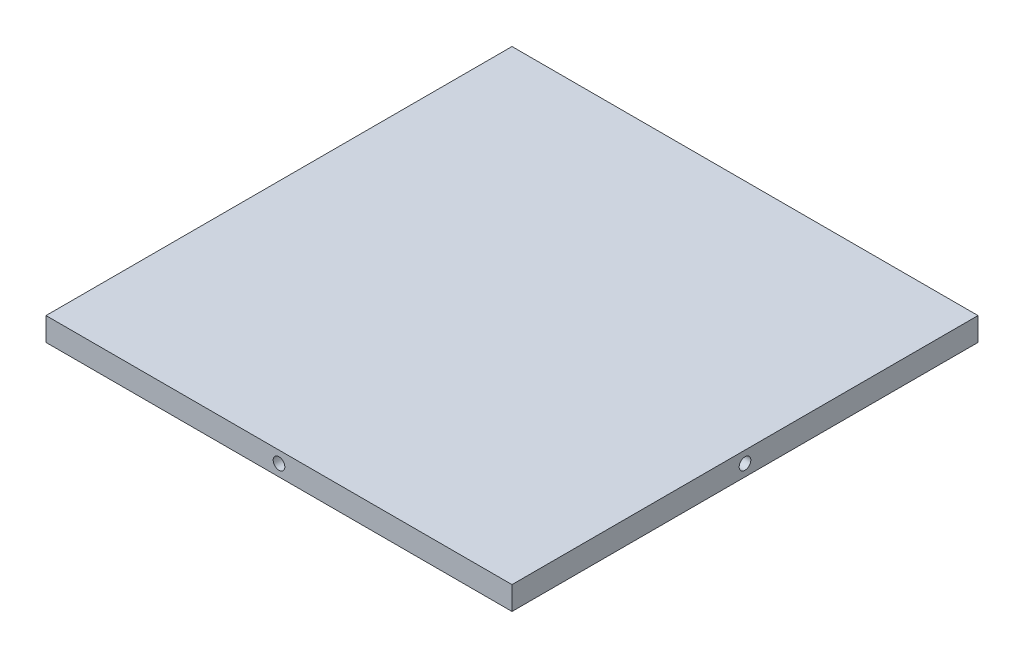
ISO-10303-21;
HEADER;
FILE_DESCRIPTION(('STEP AP214'),'2;1');
FILE_NAME('part.step','',(''),(''),'','','');
FILE_SCHEMA(('AUTOMOTIVE_DESIGN { 1 0 10303 214 1 1 1 1 }'));
ENDSEC;
DATA;
#1=APPLICATION_CONTEXT('core data for automotive mechanical design processes');
#2=APPLICATION_PROTOCOL_DEFINITION('international standard','automotive_design',2000,#1);
#3=PRODUCT_CONTEXT('',#1,'mechanical');
#4=PRODUCT('Part','Part','',(#3));
#5=PRODUCT_RELATED_PRODUCT_CATEGORY('part','',(#4));
#6=PRODUCT_DEFINITION_FORMATION('','',#4);
#7=PRODUCT_DEFINITION_CONTEXT('part definition',#1,'design');
#8=PRODUCT_DEFINITION('design','',#6,#7);
#9=PRODUCT_DEFINITION_SHAPE('','',#8);
#10=(LENGTH_UNIT() NAMED_UNIT(*) SI_UNIT(.MILLI.,.METRE.));
#11=(NAMED_UNIT(*) PLANE_ANGLE_UNIT() SI_UNIT($,.RADIAN.));
#12=(NAMED_UNIT(*) SI_UNIT($,.STERADIAN.) SOLID_ANGLE_UNIT());
#13=UNCERTAINTY_MEASURE_WITH_UNIT(LENGTH_MEASURE(1.E-05),#10,'distance_accuracy_value','');
#14=(GEOMETRIC_REPRESENTATION_CONTEXT(3) GLOBAL_UNCERTAINTY_ASSIGNED_CONTEXT((#13)) GLOBAL_UNIT_ASSIGNED_CONTEXT((#10,
#11,#12)) REPRESENTATION_CONTEXT('',''));
#15=CARTESIAN_POINT('',(0.,0.,0.));
#16=DIRECTION('',(0.,0.,1.));
#17=DIRECTION('',(1.,0.,0.));
#18=AXIS2_PLACEMENT_3D('',#15,#16,#17);
#19=CARTESIAN_POINT('',(60.,6.,60.));
#20=DIRECTION('',(-1.,0.,0.));
#21=DIRECTION('',(0.,0.,1.));
#22=AXIS2_PLACEMENT_3D('',#19,#20,#21);
#23=PLANE('',#22);
#24=CARTESIAN_POINT('',(60.,3.,0.));
#25=DIRECTION('',(1.,0.,0.));
#26=DIRECTION('',(0.,0.,-1.));
#27=AXIS2_PLACEMENT_3D('',#24,#25,#26);
#28=CIRCLE('',#27,1.5);
#29=CARTESIAN_POINT('',(60.,3.,-1.50000000000001));
#30=VERTEX_POINT('',#29);
#31=EDGE_CURVE('E127',#30,#30,#28,.T.);
#32=ORIENTED_EDGE('',*,*,#31,.F.);
#33=EDGE_LOOP('',(#32));
#34=FACE_BOUND('',#33,.T.);
#35=DIRECTION('',(0.,0.,-1.));
#36=VECTOR('',#35,1.);
#37=CARTESIAN_POINT('',(60.,0.,60.));
#38=LINE('',#37,#36);
#39=CARTESIAN_POINT('',(60.,0.,60.));
#40=VERTEX_POINT('',#39);
#41=CARTESIAN_POINT('',(60.,0.,-60.));
#42=VERTEX_POINT('',#41);
#43=EDGE_CURVE('E106',#40,#42,#38,.T.);
#44=ORIENTED_EDGE('',*,*,#43,.T.);
#45=DIRECTION('',(0.,-1.,0.));
#46=VECTOR('',#45,1.);
#47=CARTESIAN_POINT('',(60.,6.,-60.));
#48=LINE('',#47,#46);
#49=CARTESIAN_POINT('',(60.,6.,-60.));
#50=VERTEX_POINT('',#49);
#51=EDGE_CURVE('E11',#50,#42,#48,.T.);
#52=ORIENTED_EDGE('',*,*,#51,.F.);
#53=DIRECTION('',(0.,0.,-1.));
#54=VECTOR('',#53,1.);
#55=CARTESIAN_POINT('',(60.,6.,60.));
#56=LINE('',#55,#54);
#57=CARTESIAN_POINT('',(60.,6.,60.));
#58=VERTEX_POINT('',#57);
#59=EDGE_CURVE('E90',#58,#50,#56,.T.);
#60=ORIENTED_EDGE('',*,*,#59,.F.);
#61=DIRECTION('',(0.,-1.,0.));
#62=VECTOR('',#61,1.);
#63=CARTESIAN_POINT('',(60.,6.,60.));
#64=LINE('',#63,#62);
#65=EDGE_CURVE('E102',#58,#40,#64,.T.);
#66=ORIENTED_EDGE('',*,*,#65,.T.);
#67=EDGE_LOOP('',(#44,#52,#60,#66));
#68=FACE_BOUND('',#67,.T.);
#69=ADVANCED_FACE('F38',(#34,#68),#23,.F.);
#70=CARTESIAN_POINT('',(-60.,6.,-60.));
#71=DIRECTION('',(0.,0.,1.));
#72=DIRECTION('',(1.,0.,0.));
#73=AXIS2_PLACEMENT_3D('',#70,#71,#72);
#74=PLANE('',#73);
#75=CARTESIAN_POINT('',(0.,3.,-60.));
#76=DIRECTION('',(0.,0.,-1.));
#77=DIRECTION('',(-1.,0.,0.));
#78=AXIS2_PLACEMENT_3D('',#75,#76,#77);
#79=CIRCLE('',#78,1.5);
#80=CARTESIAN_POINT('',(-1.49999999999999,3.,-60.));
#81=VERTEX_POINT('',#80);
#82=EDGE_CURVE('E135',#81,#81,#79,.T.);
#83=ORIENTED_EDGE('',*,*,#82,.F.);
#84=EDGE_LOOP('',(#83));
#85=FACE_BOUND('',#84,.T.);
#86=DIRECTION('',(-1.,0.,0.));
#87=VECTOR('',#86,1.);
#88=CARTESIAN_POINT('',(-60.,0.,-60.));
#89=LINE('',#88,#87);
#90=CARTESIAN_POINT('',(-60.,0.,-60.));
#91=VERTEX_POINT('',#90);
#92=EDGE_CURVE('E95',#42,#91,#89,.T.);
#93=ORIENTED_EDGE('',*,*,#92,.T.);
#94=DIRECTION('',(0.,-1.,0.));
#95=VECTOR('',#94,1.);
#96=CARTESIAN_POINT('',(-60.,6.,-60.));
#97=LINE('',#96,#95);
#98=CARTESIAN_POINT('',(-60.,6.,-60.));
#99=VERTEX_POINT('',#98);
#100=EDGE_CURVE('E47',#99,#91,#97,.T.);
#101=ORIENTED_EDGE('',*,*,#100,.F.);
#102=DIRECTION('',(-1.,0.,0.));
#103=VECTOR('',#102,1.);
#104=CARTESIAN_POINT('',(-60.,6.,-60.));
#105=LINE('',#104,#103);
#106=EDGE_CURVE('E85',#50,#99,#105,.T.);
#107=ORIENTED_EDGE('',*,*,#106,.F.);
#108=ORIENTED_EDGE('',*,*,#51,.T.);
#109=EDGE_LOOP('',(#93,#101,#107,#108));
#110=FACE_BOUND('',#109,.T.);
#111=ADVANCED_FACE('F94',(#85,#110),#74,.F.);
#112=CARTESIAN_POINT('',(-60.,6.,60.));
#113=DIRECTION('',(1.,0.,0.));
#114=DIRECTION('',(0.,0.,-1.));
#115=AXIS2_PLACEMENT_3D('',#112,#113,#114);
#116=PLANE('',#115);
#117=CARTESIAN_POINT('',(-60.,3.,0.));
#118=DIRECTION('',(-1.,0.,0.));
#119=DIRECTION('',(0.,0.,1.));
#120=AXIS2_PLACEMENT_3D('',#117,#118,#119);
#121=CIRCLE('',#120,1.5);
#122=CARTESIAN_POINT('',(-60.,3.,1.50000000000001));
#123=VERTEX_POINT('',#122);
#124=EDGE_CURVE('E143',#123,#123,#121,.T.);
#125=ORIENTED_EDGE('',*,*,#124,.F.);
#126=EDGE_LOOP('',(#125));
#127=FACE_BOUND('',#126,.T.);
#128=DIRECTION('',(0.,0.,1.));
#129=VECTOR('',#128,1.);
#130=CARTESIAN_POINT('',(-60.,0.,60.));
#131=LINE('',#130,#129);
#132=CARTESIAN_POINT('',(-60.,0.,60.));
#133=VERTEX_POINT('',#132);
#134=EDGE_CURVE('E72',#91,#133,#131,.T.);
#135=ORIENTED_EDGE('',*,*,#134,.T.);
#136=DIRECTION('',(0.,-1.,0.));
#137=VECTOR('',#136,1.);
#138=CARTESIAN_POINT('',(-60.,6.,60.));
#139=LINE('',#138,#137);
#140=CARTESIAN_POINT('',(-60.,6.,60.));
#141=VERTEX_POINT('',#140);
#142=EDGE_CURVE('E97',#141,#133,#139,.T.);
#143=ORIENTED_EDGE('',*,*,#142,.F.);
#144=DIRECTION('',(0.,0.,1.));
#145=VECTOR('',#144,1.);
#146=CARTESIAN_POINT('',(-60.,6.,60.));
#147=LINE('',#146,#145);
#148=EDGE_CURVE('E88',#99,#141,#147,.T.);
#149=ORIENTED_EDGE('',*,*,#148,.F.);
#150=ORIENTED_EDGE('',*,*,#100,.T.);
#151=EDGE_LOOP('',(#135,#143,#149,#150));
#152=FACE_BOUND('',#151,.T.);
#153=ADVANCED_FACE('F98',(#127,#152),#116,.F.);
#154=CARTESIAN_POINT('',(-60.,6.,60.));
#155=DIRECTION('',(0.,0.,-1.));
#156=DIRECTION('',(-1.,0.,0.));
#157=AXIS2_PLACEMENT_3D('',#154,#155,#156);
#158=PLANE('',#157);
#159=CARTESIAN_POINT('',(0.,3.,60.));
#160=DIRECTION('',(0.,0.,1.));
#161=DIRECTION('',(1.,0.,0.));
#162=AXIS2_PLACEMENT_3D('',#159,#160,#161);
#163=CIRCLE('',#162,1.5);
#164=CARTESIAN_POINT('',(1.50000000000002,3.,60.));
#165=VERTEX_POINT('',#164);
#166=EDGE_CURVE('E151',#165,#165,#163,.T.);
#167=ORIENTED_EDGE('',*,*,#166,.F.);
#168=EDGE_LOOP('',(#167));
#169=FACE_BOUND('',#168,.T.);
#170=DIRECTION('',(1.,0.,0.));
#171=VECTOR('',#170,1.);
#172=CARTESIAN_POINT('',(-60.,0.,60.));
#173=LINE('',#172,#171);
#174=EDGE_CURVE('E78',#133,#40,#173,.T.);
#175=ORIENTED_EDGE('',*,*,#174,.T.);
#176=ORIENTED_EDGE('',*,*,#65,.F.);
#177=DIRECTION('',(1.,0.,0.));
#178=VECTOR('',#177,1.);
#179=CARTESIAN_POINT('',(-60.,6.,60.));
#180=LINE('',#179,#178);
#181=EDGE_CURVE('E55',#141,#58,#180,.T.);
#182=ORIENTED_EDGE('',*,*,#181,.F.);
#183=ORIENTED_EDGE('',*,*,#142,.T.);
#184=EDGE_LOOP('',(#175,#176,#182,#183));
#185=FACE_BOUND('',#184,.T.);
#186=ADVANCED_FACE('F120',(#169,#185),#158,.F.);
#187=CARTESIAN_POINT('',(0.,6.,0.));
#188=DIRECTION('',(0.,-1.,0.));
#189=DIRECTION('',(0.,0.,-1.));
#190=AXIS2_PLACEMENT_3D('',#187,#188,#189);
#191=PLANE('',#190);
#192=ORIENTED_EDGE('',*,*,#59,.T.);
#193=ORIENTED_EDGE('',*,*,#106,.T.);
#194=ORIENTED_EDGE('',*,*,#148,.T.);
#195=ORIENTED_EDGE('',*,*,#181,.T.);
#196=EDGE_LOOP('',(#192,#193,#194,#195));
#197=FACE_BOUND('',#196,.T.);
#198=ADVANCED_FACE('F86',(#197),#191,.F.);
#199=CARTESIAN_POINT('',(0.,0.,0.));
#200=DIRECTION('',(0.,-1.,0.));
#201=DIRECTION('',(0.,0.,-1.));
#202=AXIS2_PLACEMENT_3D('',#199,#200,#201);
#203=PLANE('',#202);
#204=ORIENTED_EDGE('',*,*,#43,.F.);
#205=ORIENTED_EDGE('',*,*,#174,.F.);
#206=ORIENTED_EDGE('',*,*,#134,.F.);
#207=ORIENTED_EDGE('',*,*,#92,.F.);
#208=EDGE_LOOP('',(#204,#205,#206,#207));
#209=FACE_BOUND('',#208,.T.);
#210=ADVANCED_FACE('F123',(#209),#203,.T.);
#211=CARTESIAN_POINT('',(44.,3.,0.));
#212=DIRECTION('',(1.,0.,0.));
#213=DIRECTION('',(0.,0.,-1.));
#214=AXIS2_PLACEMENT_3D('',#211,#212,#213);
#215=CYLINDRICAL_SURFACE('',#214,1.5);
#216=CARTESIAN_POINT('',(44.,3.,0.));
#217=DIRECTION('',(1.,0.,0.));
#218=DIRECTION('',(0.,0.,-1.));
#219=AXIS2_PLACEMENT_3D('',#216,#217,#218);
#220=CIRCLE('',#219,1.5);
#221=CARTESIAN_POINT('',(44.,3.,-1.50000000000001));
#222=VERTEX_POINT('',#221);
#223=EDGE_CURVE('E110',#222,#222,#220,.T.);
#224=ORIENTED_EDGE('',*,*,#223,.F.);
#225=EDGE_LOOP('',(#224));
#226=FACE_BOUND('',#225,.T.);
#227=ORIENTED_EDGE('',*,*,#31,.T.);
#228=EDGE_LOOP('',(#227));
#229=FACE_BOUND('',#228,.T.);
#230=ADVANCED_FACE('F190',(#226,#229),#215,.F.);
#231=CARTESIAN_POINT('',(44.,3.,0.));
#232=DIRECTION('',(1.,0.,0.));
#233=DIRECTION('',(0.,0.,-1.));
#234=AXIS2_PLACEMENT_3D('',#231,#232,#233);
#235=PLANE('',#234);
#236=ORIENTED_EDGE('',*,*,#223,.T.);
#237=EDGE_LOOP('',(#236));
#238=FACE_BOUND('',#237,.T.);
#239=ADVANCED_FACE('F192',(#238),#235,.T.);
#240=CARTESIAN_POINT('',(0.,3.,-44.));
#241=DIRECTION('',(0.,0.,-1.));
#242=DIRECTION('',(-1.,0.,0.));
#243=AXIS2_PLACEMENT_3D('',#240,#241,#242);
#244=CYLINDRICAL_SURFACE('',#243,1.5);
#245=CARTESIAN_POINT('',(0.,3.,-44.));
#246=DIRECTION('',(0.,0.,-1.));
#247=DIRECTION('',(-1.,0.,0.));
#248=AXIS2_PLACEMENT_3D('',#245,#246,#247);
#249=CIRCLE('',#248,1.5);
#250=CARTESIAN_POINT('',(-1.49999999999999,3.,-44.));
#251=VERTEX_POINT('',#250);
#252=EDGE_CURVE('E131',#251,#251,#249,.T.);
#253=ORIENTED_EDGE('',*,*,#252,.F.);
#254=EDGE_LOOP('',(#253));
#255=FACE_BOUND('',#254,.T.);
#256=ORIENTED_EDGE('',*,*,#82,.T.);
#257=EDGE_LOOP('',(#256));
#258=FACE_BOUND('',#257,.T.);
#259=ADVANCED_FACE('F198',(#255,#258),#244,.F.);
#260=CARTESIAN_POINT('',(0.,3.,-44.));
#261=DIRECTION('',(0.,0.,-1.));
#262=DIRECTION('',(-1.,0.,0.));
#263=AXIS2_PLACEMENT_3D('',#260,#261,#262);
#264=PLANE('',#263);
#265=ORIENTED_EDGE('',*,*,#252,.T.);
#266=EDGE_LOOP('',(#265));
#267=FACE_BOUND('',#266,.T.);
#268=ADVANCED_FACE('F205',(#267),#264,.T.);
#269=CARTESIAN_POINT('',(-44.,3.,0.));
#270=DIRECTION('',(-1.,0.,0.));
#271=DIRECTION('',(0.,0.,1.));
#272=AXIS2_PLACEMENT_3D('',#269,#270,#271);
#273=CYLINDRICAL_SURFACE('',#272,1.5);
#274=CARTESIAN_POINT('',(-44.,3.,0.));
#275=DIRECTION('',(-1.,0.,0.));
#276=DIRECTION('',(0.,0.,1.));
#277=AXIS2_PLACEMENT_3D('',#274,#275,#276);
#278=CIRCLE('',#277,1.5);
#279=CARTESIAN_POINT('',(-44.,3.,1.50000000000001));
#280=VERTEX_POINT('',#279);
#281=EDGE_CURVE('E139',#280,#280,#278,.T.);
#282=ORIENTED_EDGE('',*,*,#281,.F.);
#283=EDGE_LOOP('',(#282));
#284=FACE_BOUND('',#283,.T.);
#285=ORIENTED_EDGE('',*,*,#124,.T.);
#286=EDGE_LOOP('',(#285));
#287=FACE_BOUND('',#286,.T.);
#288=ADVANCED_FACE('F209',(#284,#287),#273,.F.);
#289=CARTESIAN_POINT('',(-44.,3.,0.));
#290=DIRECTION('',(-1.,0.,0.));
#291=DIRECTION('',(0.,0.,1.));
#292=AXIS2_PLACEMENT_3D('',#289,#290,#291);
#293=PLANE('',#292);
#294=ORIENTED_EDGE('',*,*,#281,.T.);
#295=EDGE_LOOP('',(#294));
#296=FACE_BOUND('',#295,.T.);
#297=ADVANCED_FACE('F164',(#296),#293,.T.);
#298=CARTESIAN_POINT('',(0.,3.,44.));
#299=DIRECTION('',(0.,0.,1.));
#300=DIRECTION('',(1.,0.,0.));
#301=AXIS2_PLACEMENT_3D('',#298,#299,#300);
#302=CYLINDRICAL_SURFACE('',#301,1.5);
#303=CARTESIAN_POINT('',(0.,3.,44.));
#304=DIRECTION('',(0.,0.,1.));
#305=DIRECTION('',(1.,0.,0.));
#306=AXIS2_PLACEMENT_3D('',#303,#304,#305);
#307=CIRCLE('',#306,1.5);
#308=CARTESIAN_POINT('',(1.50000000000002,3.,44.));
#309=VERTEX_POINT('',#308);
#310=EDGE_CURVE('E147',#309,#309,#307,.T.);
#311=ORIENTED_EDGE('',*,*,#310,.F.);
#312=EDGE_LOOP('',(#311));
#313=FACE_BOUND('',#312,.T.);
#314=ORIENTED_EDGE('',*,*,#166,.T.);
#315=EDGE_LOOP('',(#314));
#316=FACE_BOUND('',#315,.T.);
#317=ADVANCED_FACE('F161',(#313,#316),#302,.F.);
#318=CARTESIAN_POINT('',(0.,3.,44.));
#319=DIRECTION('',(0.,0.,1.));
#320=DIRECTION('',(1.,0.,0.));
#321=AXIS2_PLACEMENT_3D('',#318,#319,#320);
#322=PLANE('',#321);
#323=ORIENTED_EDGE('',*,*,#310,.T.);
#324=EDGE_LOOP('',(#323));
#325=FACE_BOUND('',#324,.T.);
#326=ADVANCED_FACE('F159',(#325),#322,.T.);
#327=CLOSED_SHELL('',(#69,#111,#153,#186,#198,#210,#230,#239,#259,#268,#288,#297,#317,#326));
#328=MANIFOLD_SOLID_BREP('B2',#327);
#329=ADVANCED_BREP_SHAPE_REPRESENTATION('',(#18,#328),#14);
#330=SHAPE_DEFINITION_REPRESENTATION(#9,#329);
ENDSEC;
END-ISO-10303-21;
